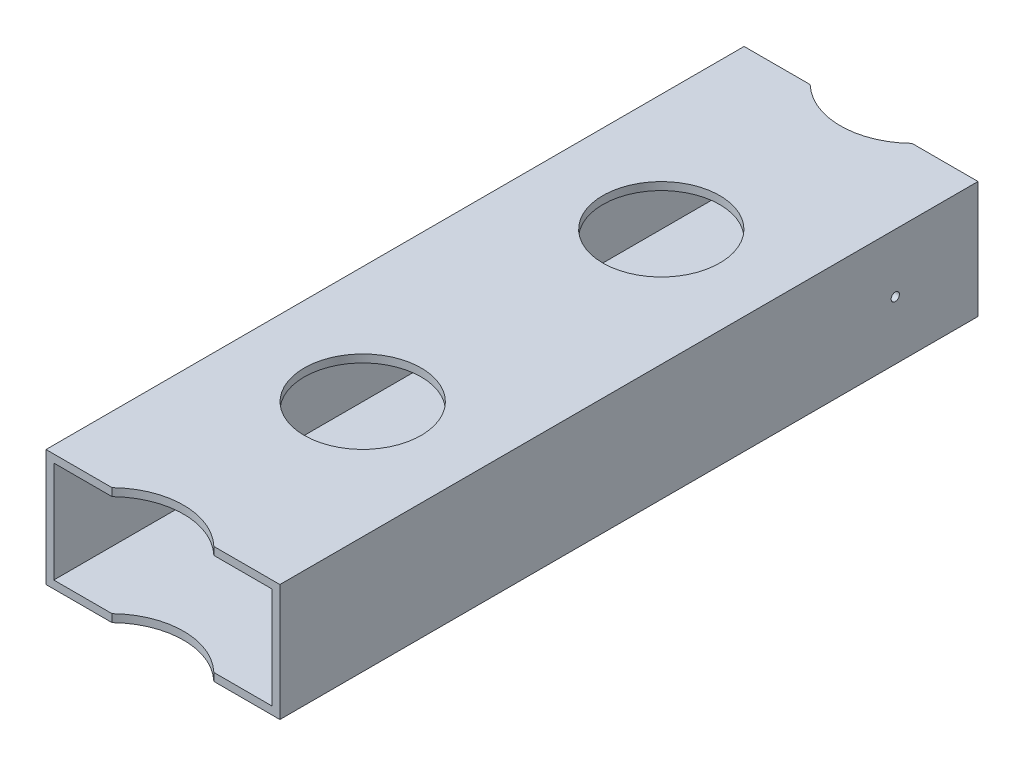
ISO-10303-21;
HEADER;
FILE_DESCRIPTION(('STEP AP214'),'2;1');
FILE_NAME('part.step','',(''),(''),'','','');
FILE_SCHEMA(('AUTOMOTIVE_DESIGN { 1 0 10303 214 1 1 1 1 }'));
ENDSEC;
DATA;
#1=APPLICATION_CONTEXT('core data for automotive mechanical design processes');
#2=APPLICATION_PROTOCOL_DEFINITION('international standard','automotive_design',2000,#1);
#3=PRODUCT_CONTEXT('',#1,'mechanical');
#4=PRODUCT('Part','Part','',(#3));
#5=PRODUCT_RELATED_PRODUCT_CATEGORY('part','',(#4));
#6=PRODUCT_DEFINITION_FORMATION('','',#4);
#7=PRODUCT_DEFINITION_CONTEXT('part definition',#1,'design');
#8=PRODUCT_DEFINITION('design','',#6,#7);
#9=PRODUCT_DEFINITION_SHAPE('','',#8);
#10=(LENGTH_UNIT() NAMED_UNIT(*) SI_UNIT(.MILLI.,.METRE.));
#11=(NAMED_UNIT(*) PLANE_ANGLE_UNIT() SI_UNIT($,.RADIAN.));
#12=(NAMED_UNIT(*) SI_UNIT($,.STERADIAN.) SOLID_ANGLE_UNIT());
#13=UNCERTAINTY_MEASURE_WITH_UNIT(LENGTH_MEASURE(1.E-05),#10,'distance_accuracy_value','');
#14=(GEOMETRIC_REPRESENTATION_CONTEXT(3) GLOBAL_UNCERTAINTY_ASSIGNED_CONTEXT((#13)) GLOBAL_UNIT_ASSIGNED_CONTEXT((#10,
#11,#12)) REPRESENTATION_CONTEXT('',''));
#15=CARTESIAN_POINT('',(0.,0.,0.));
#16=DIRECTION('',(0.,0.,1.));
#17=DIRECTION('',(1.,0.,0.));
#18=AXIS2_PLACEMENT_3D('',#15,#16,#17);
#19=CARTESIAN_POINT('',(0.,-16.51,261.62));
#20=DIRECTION('',(0.,1.,0.));
#21=DIRECTION('',(0.,0.,1.));
#22=AXIS2_PLACEMENT_3D('',#19,#20,#21);
#23=PLANE('',#22);
#24=CARTESIAN_POINT('',(0.,-16.51,179.446397460216));
#25=DIRECTION('',(0.,1.,0.));
#26=DIRECTION('',(0.,0.,1.));
#27=AXIS2_PLACEMENT_3D('',#24,#25,#26);
#28=CIRCLE('',#27,19.05);
#29=CARTESIAN_POINT('',(0.,-16.51,198.496397460216));
#30=VERTEX_POINT('',#29);
#31=EDGE_CURVE('E291',#30,#30,#28,.T.);
#32=ORIENTED_EDGE('',*,*,#31,.F.);
#33=EDGE_LOOP('',(#32));
#34=FACE_BOUND('',#33,.T.);
#35=CARTESIAN_POINT('',(0.,-16.51,82.1736025397836));
#36=DIRECTION('',(0.,1.,0.));
#37=DIRECTION('',(0.,0.,1.));
#38=AXIS2_PLACEMENT_3D('',#35,#36,#37);
#39=CIRCLE('',#38,19.05);
#40=CARTESIAN_POINT('',(0.,-16.51,101.223602539784));
#41=VERTEX_POINT('',#40);
#42=EDGE_CURVE('E311',#41,#41,#39,.T.);
#43=ORIENTED_EDGE('',*,*,#42,.F.);
#44=EDGE_LOOP('',(#43));
#45=FACE_BOUND('',#44,.T.);
#46=DIRECTION('',(-1.,0.,0.));
#47=VECTOR('',#46,1.);
#48=CARTESIAN_POINT('',(0.,-16.51,244.533897460216));
#49=LINE('',#48,#47);
#50=CARTESIAN_POINT('',(-16.5861465159934,-16.51,244.533897460216));
#51=VERTEX_POINT('',#50);
#52=CARTESIAN_POINT('',(-35.56,-16.51,244.533897460216));
#53=VERTEX_POINT('',#52);
#54=EDGE_CURVE('E12',#51,#53,#49,.T.);
#55=ORIENTED_EDGE('',*,*,#54,.F.);
#56=CARTESIAN_POINT('',(0.,-16.51,261.62));
#57=DIRECTION('',(0.,1.,0.));
#58=DIRECTION('',(0.,0.,1.));
#59=AXIS2_PLACEMENT_3D('',#56,#57,#58);
#60=CIRCLE('',#59,23.8125);
#61=CARTESIAN_POINT('',(16.5861465159934,-16.51,244.533897460216));
#62=VERTEX_POINT('',#61);
#63=EDGE_CURVE('E69',#62,#51,#60,.T.);
#64=ORIENTED_EDGE('',*,*,#63,.F.);
#65=DIRECTION('',(-1.,0.,0.));
#66=VECTOR('',#65,1.);
#67=CARTESIAN_POINT('',(0.,-16.51,244.533897460216));
#68=LINE('',#67,#66);
#69=CARTESIAN_POINT('',(35.56,-16.51,244.533897460216));
#70=VERTEX_POINT('',#69);
#71=EDGE_CURVE('E219',#70,#62,#68,.T.);
#72=ORIENTED_EDGE('',*,*,#71,.F.);
#73=DIRECTION('',(0.,0.,-1.));
#74=VECTOR('',#73,1.);
#75=CARTESIAN_POINT('',(35.56,-16.51,261.62));
#76=LINE('',#75,#74);
#77=CARTESIAN_POINT('',(35.56,-16.51,17.0861025397836));
#78=VERTEX_POINT('',#77);
#79=EDGE_CURVE('E241',#70,#78,#76,.T.);
#80=ORIENTED_EDGE('',*,*,#79,.T.);
#81=DIRECTION('',(-1.,0.,0.));
#82=VECTOR('',#81,1.);
#83=CARTESIAN_POINT('',(-1.18304801019034E-13,-16.51,17.0861025397836));
#84=LINE('',#83,#82);
#85=CARTESIAN_POINT('',(16.5861465159934,-16.51,17.0861025397836));
#86=VERTEX_POINT('',#85);
#87=EDGE_CURVE('E210',#78,#86,#84,.T.);
#88=ORIENTED_EDGE('',*,*,#87,.T.);
#89=CARTESIAN_POINT('',(0.,-16.51,0.));
#90=DIRECTION('',(0.,1.,0.));
#91=DIRECTION('',(0.,0.,1.));
#92=AXIS2_PLACEMENT_3D('',#89,#90,#91);
#93=CIRCLE('',#92,23.8125);
#94=CARTESIAN_POINT('',(-16.5861465159934,-16.51,17.0861025397836));
#95=VERTEX_POINT('',#94);
#96=EDGE_CURVE('E213',#95,#86,#93,.T.);
#97=ORIENTED_EDGE('',*,*,#96,.F.);
#98=DIRECTION('',(-1.,0.,0.));
#99=VECTOR('',#98,1.);
#100=CARTESIAN_POINT('',(1.18304801019034E-13,-16.51,17.0861025397836));
#101=LINE('',#100,#99);
#102=CARTESIAN_POINT('',(-35.56,-16.51,17.0861025397836));
#103=VERTEX_POINT('',#102);
#104=EDGE_CURVE('E216',#95,#103,#101,.T.);
#105=ORIENTED_EDGE('',*,*,#104,.T.);
#106=DIRECTION('',(0.,0.,-1.));
#107=VECTOR('',#106,1.);
#108=CARTESIAN_POINT('',(-35.56,-16.51,261.62));
#109=LINE('',#108,#107);
#110=EDGE_CURVE('E237',#53,#103,#109,.T.);
#111=ORIENTED_EDGE('',*,*,#110,.F.);
#112=EDGE_LOOP('',(#55,#64,#72,#80,#88,#97,#105,#111));
#113=FACE_BOUND('',#112,.T.);
#114=ADVANCED_FACE('F61',(#34,#45,#113),#23,.T.);
#115=CARTESIAN_POINT('',(-35.56,0.,261.62));
#116=DIRECTION('',(1.,0.,0.));
#117=DIRECTION('',(0.,0.,-1.));
#118=AXIS2_PLACEMENT_3D('',#115,#116,#117);
#119=PLANE('',#118);
#120=CARTESIAN_POINT('',(-35.56,0.,44.0448471531738));
#121=DIRECTION('',(1.,0.,0.));
#122=DIRECTION('',(0.,0.,-1.));
#123=AXIS2_PLACEMENT_3D('',#120,#121,#122);
#124=CIRCLE('',#123,1.34620000000004);
#125=CARTESIAN_POINT('',(-35.56,0.,42.6986471531738));
#126=VERTEX_POINT('',#125);
#127=EDGE_CURVE('E322',#126,#126,#124,.T.);
#128=ORIENTED_EDGE('',*,*,#127,.F.);
#129=EDGE_LOOP('',(#128));
#130=FACE_BOUND('',#129,.T.);
#131=DIRECTION('',(0.,1.,0.));
#132=VECTOR('',#131,1.);
#133=CARTESIAN_POINT('',(-35.56,0.,244.533897460216));
#134=LINE('',#133,#132);
#135=CARTESIAN_POINT('',(-35.56,16.51,244.533897460216));
#136=VERTEX_POINT('',#135);
#137=EDGE_CURVE('E249',#53,#136,#134,.T.);
#138=ORIENTED_EDGE('',*,*,#137,.F.);
#139=ORIENTED_EDGE('',*,*,#110,.T.);
#140=DIRECTION('',(0.,1.,0.));
#141=VECTOR('',#140,1.);
#142=CARTESIAN_POINT('',(-35.56,0.,17.0861025397836));
#143=LINE('',#142,#141);
#144=CARTESIAN_POINT('',(-35.56,16.51,17.0861025397836));
#145=VERTEX_POINT('',#144);
#146=EDGE_CURVE('E262',#103,#145,#143,.T.);
#147=ORIENTED_EDGE('',*,*,#146,.T.);
#148=DIRECTION('',(0.,0.,-1.));
#149=VECTOR('',#148,1.);
#150=CARTESIAN_POINT('',(-35.56,16.51,261.62));
#151=LINE('',#150,#149);
#152=EDGE_CURVE('E203',#136,#145,#151,.T.);
#153=ORIENTED_EDGE('',*,*,#152,.F.);
#154=EDGE_LOOP('',(#138,#139,#147,#153));
#155=FACE_BOUND('',#154,.T.);
#156=ADVANCED_FACE('F361',(#130,#155),#119,.T.);
#157=CARTESIAN_POINT('',(0.,16.51,261.62));
#158=DIRECTION('',(0.,-1.,0.));
#159=DIRECTION('',(0.,0.,-1.));
#160=AXIS2_PLACEMENT_3D('',#157,#158,#159);
#161=PLANE('',#160);
#162=CARTESIAN_POINT('',(0.,16.51,179.446397460216));
#163=DIRECTION('',(0.,-1.,0.));
#164=DIRECTION('',(0.,0.,-1.));
#165=AXIS2_PLACEMENT_3D('',#162,#163,#164);
#166=CIRCLE('',#165,19.05);
#167=CARTESIAN_POINT('',(0.,16.51,160.396397460216));
#168=VERTEX_POINT('',#167);
#169=EDGE_CURVE('E308',#168,#168,#166,.T.);
#170=ORIENTED_EDGE('',*,*,#169,.F.);
#171=EDGE_LOOP('',(#170));
#172=FACE_BOUND('',#171,.T.);
#173=CARTESIAN_POINT('',(0.,16.51,82.1736025397836));
#174=DIRECTION('',(0.,-1.,0.));
#175=DIRECTION('',(0.,0.,-1.));
#176=AXIS2_PLACEMENT_3D('',#173,#174,#175);
#177=CIRCLE('',#176,19.05);
#178=CARTESIAN_POINT('',(0.,16.51,63.1236025397836));
#179=VERTEX_POINT('',#178);
#180=EDGE_CURVE('E314',#179,#179,#177,.T.);
#181=ORIENTED_EDGE('',*,*,#180,.F.);
#182=EDGE_LOOP('',(#181));
#183=FACE_BOUND('',#182,.T.);
#184=DIRECTION('',(1.,0.,0.));
#185=VECTOR('',#184,1.);
#186=CARTESIAN_POINT('',(0.,16.51,244.533897460216));
#187=LINE('',#186,#185);
#188=CARTESIAN_POINT('',(-16.5861465159934,16.51,244.533897460216));
#189=VERTEX_POINT('',#188);
#190=EDGE_CURVE('E245',#136,#189,#187,.T.);
#191=ORIENTED_EDGE('',*,*,#190,.F.);
#192=ORIENTED_EDGE('',*,*,#152,.T.);
#193=DIRECTION('',(1.,0.,0.));
#194=VECTOR('',#193,1.);
#195=CARTESIAN_POINT('',(1.18304801019034E-13,16.51,17.0861025397836));
#196=LINE('',#195,#194);
#197=CARTESIAN_POINT('',(-16.5861465159934,16.51,17.0861025397836));
#198=VERTEX_POINT('',#197);
#199=EDGE_CURVE('E259',#145,#198,#196,.T.);
#200=ORIENTED_EDGE('',*,*,#199,.T.);
#201=CARTESIAN_POINT('',(0.,16.51,0.));
#202=DIRECTION('',(0.,-1.,0.));
#203=DIRECTION('',(0.,0.,-1.));
#204=AXIS2_PLACEMENT_3D('',#201,#202,#203);
#205=CIRCLE('',#204,23.8125);
#206=CARTESIAN_POINT('',(16.5861465159934,16.51,17.0861025397836));
#207=VERTEX_POINT('',#206);
#208=EDGE_CURVE('E257',#207,#198,#205,.T.);
#209=ORIENTED_EDGE('',*,*,#208,.F.);
#210=DIRECTION('',(1.,0.,0.));
#211=VECTOR('',#210,1.);
#212=CARTESIAN_POINT('',(-1.18304801019034E-13,16.51,17.0861025397836));
#213=LINE('',#212,#211);
#214=CARTESIAN_POINT('',(35.56,16.51,17.0861025397836));
#215=VERTEX_POINT('',#214);
#216=EDGE_CURVE('E264',#207,#215,#213,.T.);
#217=ORIENTED_EDGE('',*,*,#216,.T.);
#218=DIRECTION('',(0.,0.,-1.));
#219=VECTOR('',#218,1.);
#220=CARTESIAN_POINT('',(35.56,16.51,261.62));
#221=LINE('',#220,#219);
#222=CARTESIAN_POINT('',(35.56,16.51,244.533897460216));
#223=VERTEX_POINT('',#222);
#224=EDGE_CURVE('E197',#223,#215,#221,.T.);
#225=ORIENTED_EDGE('',*,*,#224,.F.);
#226=DIRECTION('',(1.,0.,0.));
#227=VECTOR('',#226,1.);
#228=CARTESIAN_POINT('',(0.,16.51,244.533897460216));
#229=LINE('',#228,#227);
#230=CARTESIAN_POINT('',(16.5861465159934,16.51,244.533897460216));
#231=VERTEX_POINT('',#230);
#232=EDGE_CURVE('E253',#231,#223,#229,.T.);
#233=ORIENTED_EDGE('',*,*,#232,.F.);
#234=CARTESIAN_POINT('',(0.,16.51,261.62));
#235=DIRECTION('',(0.,-1.,0.));
#236=DIRECTION('',(0.,0.,-1.));
#237=AXIS2_PLACEMENT_3D('',#234,#235,#236);
#238=CIRCLE('',#237,23.8125);
#239=EDGE_CURVE('E251',#189,#231,#238,.T.);
#240=ORIENTED_EDGE('',*,*,#239,.F.);
#241=EDGE_LOOP('',(#191,#192,#200,#209,#217,#225,#233,#240));
#242=FACE_BOUND('',#241,.T.);
#243=ADVANCED_FACE('F367',(#172,#183,#242),#161,.T.);
#244=CARTESIAN_POINT('',(35.56,0.,261.62));
#245=DIRECTION('',(-1.,0.,0.));
#246=DIRECTION('',(0.,0.,1.));
#247=AXIS2_PLACEMENT_3D('',#244,#245,#246);
#248=PLANE('',#247);
#249=CARTESIAN_POINT('',(35.56,0.,44.0448471531738));
#250=DIRECTION('',(-1.,0.,0.));
#251=DIRECTION('',(0.,0.,1.));
#252=AXIS2_PLACEMENT_3D('',#249,#250,#251);
#253=CIRCLE('',#252,1.34620000000004);
#254=CARTESIAN_POINT('',(35.56,0.,45.3910471531738));
#255=VERTEX_POINT('',#254);
#256=EDGE_CURVE('E332',#255,#255,#253,.T.);
#257=ORIENTED_EDGE('',*,*,#256,.F.);
#258=EDGE_LOOP('',(#257));
#259=FACE_BOUND('',#258,.T.);
#260=DIRECTION('',(0.,-1.,0.));
#261=VECTOR('',#260,1.);
#262=CARTESIAN_POINT('',(35.56,0.,244.533897460216));
#263=LINE('',#262,#261);
#264=EDGE_CURVE('E255',#223,#70,#263,.T.);
#265=ORIENTED_EDGE('',*,*,#264,.F.);
#266=ORIENTED_EDGE('',*,*,#224,.T.);
#267=DIRECTION('',(0.,-1.,0.));
#268=VECTOR('',#267,1.);
#269=CARTESIAN_POINT('',(35.56,0.,17.0861025397836));
#270=LINE('',#269,#268);
#271=EDGE_CURVE('E267',#215,#78,#270,.T.);
#272=ORIENTED_EDGE('',*,*,#271,.T.);
#273=ORIENTED_EDGE('',*,*,#79,.F.);
#274=EDGE_LOOP('',(#265,#266,#272,#273));
#275=FACE_BOUND('',#274,.T.);
#276=ADVANCED_FACE('F378',(#259,#275),#248,.T.);
#277=CARTESIAN_POINT('',(0.,-19.05,0.));
#278=DIRECTION('',(0.,1.,0.));
#279=DIRECTION('',(0.,0.,1.));
#280=AXIS2_PLACEMENT_3D('',#277,#278,#279);
#281=CYLINDRICAL_SURFACE('',#280,23.8125);
#282=ORIENTED_EDGE('',*,*,#208,.T.);
#283=DIRECTION('',(0.,1.,0.));
#284=VECTOR('',#283,1.);
#285=CARTESIAN_POINT('',(-16.5861465159934,-19.05,17.0861025397836));
#286=LINE('',#285,#284);
#287=CARTESIAN_POINT('',(-16.5861465159934,19.05,17.0861025397836));
#288=VERTEX_POINT('',#287);
#289=EDGE_CURVE('E276',#198,#288,#286,.T.);
#290=ORIENTED_EDGE('',*,*,#289,.T.);
#291=CARTESIAN_POINT('',(0.,19.05,0.));
#292=DIRECTION('',(0.,1.,0.));
#293=DIRECTION('',(0.,0.,1.));
#294=AXIS2_PLACEMENT_3D('',#291,#292,#293);
#295=CIRCLE('',#294,23.8125);
#296=CARTESIAN_POINT('',(16.5861465159934,19.05,17.0861025397836));
#297=VERTEX_POINT('',#296);
#298=EDGE_CURVE('E288',#288,#297,#295,.T.);
#299=ORIENTED_EDGE('',*,*,#298,.T.);
#300=DIRECTION('',(0.,1.,0.));
#301=VECTOR('',#300,1.);
#302=CARTESIAN_POINT('',(16.5861465159934,-19.05,17.0861025397836));
#303=LINE('',#302,#301);
#304=EDGE_CURVE('E272',#207,#297,#303,.T.);
#305=ORIENTED_EDGE('',*,*,#304,.F.);
#306=EDGE_LOOP('',(#282,#290,#299,#305));
#307=FACE_BOUND('',#306,.T.);
#308=ADVANCED_FACE('F382',(#307),#281,.F.);
#309=ORIENTED_EDGE('',*,*,#96,.T.);
#310=CARTESIAN_POINT('',(16.5861465159934,-19.05,17.0861025397836));
#311=VERTEX_POINT('',#310);
#312=EDGE_CURVE('E270',#311,#86,#303,.T.);
#313=ORIENTED_EDGE('',*,*,#312,.F.);
#314=CARTESIAN_POINT('',(0.,-19.05,0.));
#315=DIRECTION('',(0.,1.,0.));
#316=DIRECTION('',(0.,0.,1.));
#317=AXIS2_PLACEMENT_3D('',#314,#315,#316);
#318=CIRCLE('',#317,23.8125);
#319=CARTESIAN_POINT('',(-16.5861465159934,-19.05,17.0861025397836));
#320=VERTEX_POINT('',#319);
#321=EDGE_CURVE('E284',#320,#311,#318,.T.);
#322=ORIENTED_EDGE('',*,*,#321,.F.);
#323=EDGE_CURVE('E277',#320,#95,#286,.T.);
#324=ORIENTED_EDGE('',*,*,#323,.T.);
#325=EDGE_LOOP('',(#309,#313,#322,#324));
#326=FACE_BOUND('',#325,.T.);
#327=ADVANCED_FACE('F373',(#326),#281,.F.);
#328=CARTESIAN_POINT('',(0.,-19.05,17.0861025397836));
#329=DIRECTION('',(0.,0.,-1.));
#330=DIRECTION('',(-1.,0.,0.));
#331=AXIS2_PLACEMENT_3D('',#328,#329,#330);
#332=PLANE('',#331);
#333=ORIENTED_EDGE('',*,*,#146,.F.);
#334=ORIENTED_EDGE('',*,*,#104,.F.);
#335=ORIENTED_EDGE('',*,*,#323,.F.);
#336=DIRECTION('',(-1.,0.,0.));
#337=VECTOR('',#336,1.);
#338=CARTESIAN_POINT('',(0.,-19.05,17.0861025397836));
#339=LINE('',#338,#337);
#340=CARTESIAN_POINT('',(-38.1,-19.05,17.0861025397836));
#341=VERTEX_POINT('',#340);
#342=EDGE_CURVE('E292',#320,#341,#339,.T.);
#343=ORIENTED_EDGE('',*,*,#342,.T.);
#344=DIRECTION('',(0.,1.,0.));
#345=VECTOR('',#344,1.);
#346=CARTESIAN_POINT('',(-38.1,-19.05,17.0861025397836));
#347=LINE('',#346,#345);
#348=CARTESIAN_POINT('',(-38.1,19.05,17.0861025397836));
#349=VERTEX_POINT('',#348);
#350=EDGE_CURVE('E274',#341,#349,#347,.T.);
#351=ORIENTED_EDGE('',*,*,#350,.T.);
#352=DIRECTION('',(-1.,0.,0.));
#353=VECTOR('',#352,1.);
#354=CARTESIAN_POINT('',(0.,19.05,17.0861025397836));
#355=LINE('',#354,#353);
#356=EDGE_CURVE('E281',#288,#349,#355,.T.);
#357=ORIENTED_EDGE('',*,*,#356,.F.);
#358=ORIENTED_EDGE('',*,*,#289,.F.);
#359=ORIENTED_EDGE('',*,*,#199,.F.);
#360=EDGE_LOOP('',(#333,#334,#335,#343,#351,#357,#358,#359));
#361=FACE_BOUND('',#360,.T.);
#362=ADVANCED_FACE('F410',(#361),#332,.T.);
#363=CARTESIAN_POINT('',(0.,-19.05,17.0861025397836));
#364=DIRECTION('',(0.,0.,-1.));
#365=DIRECTION('',(-1.,0.,0.));
#366=AXIS2_PLACEMENT_3D('',#363,#364,#365);
#367=PLANE('',#366);
#368=ORIENTED_EDGE('',*,*,#304,.T.);
#369=DIRECTION('',(-1.,0.,0.));
#370=VECTOR('',#369,1.);
#371=CARTESIAN_POINT('',(0.,19.05,17.0861025397836));
#372=LINE('',#371,#370);
#373=CARTESIAN_POINT('',(38.1,19.05,17.0861025397836));
#374=VERTEX_POINT('',#373);
#375=EDGE_CURVE('E285',#374,#297,#372,.T.);
#376=ORIENTED_EDGE('',*,*,#375,.F.);
#377=DIRECTION('',(0.,1.,0.));
#378=VECTOR('',#377,1.);
#379=CARTESIAN_POINT('',(38.1,-19.05,17.0861025397836));
#380=LINE('',#379,#378);
#381=CARTESIAN_POINT('',(38.1,-19.05,17.0861025397836));
#382=VERTEX_POINT('',#381);
#383=EDGE_CURVE('E84',#382,#374,#380,.T.);
#384=ORIENTED_EDGE('',*,*,#383,.F.);
#385=DIRECTION('',(-1.,0.,0.));
#386=VECTOR('',#385,1.);
#387=CARTESIAN_POINT('',(0.,-19.05,17.0861025397836));
#388=LINE('',#387,#386);
#389=EDGE_CURVE('E195',#382,#311,#388,.T.);
#390=ORIENTED_EDGE('',*,*,#389,.T.);
#391=ORIENTED_EDGE('',*,*,#312,.T.);
#392=ORIENTED_EDGE('',*,*,#87,.F.);
#393=ORIENTED_EDGE('',*,*,#271,.F.);
#394=ORIENTED_EDGE('',*,*,#216,.F.);
#395=EDGE_LOOP('',(#368,#376,#384,#390,#391,#392,#393,#394));
#396=FACE_BOUND('',#395,.T.);
#397=ADVANCED_FACE('F413',(#396),#367,.T.);
#398=CARTESIAN_POINT('',(0.,-19.05,261.62));
#399=DIRECTION('',(0.,1.,0.));
#400=DIRECTION('',(0.,0.,1.));
#401=AXIS2_PLACEMENT_3D('',#398,#399,#400);
#402=CYLINDRICAL_SURFACE('',#401,23.8125);
#403=ORIENTED_EDGE('',*,*,#239,.T.);
#404=DIRECTION('',(0.,1.,0.));
#405=VECTOR('',#404,1.);
#406=CARTESIAN_POINT('',(16.5861465159934,-19.05,244.533897460216));
#407=LINE('',#406,#405);
#408=CARTESIAN_POINT('',(16.5861465159934,19.05,244.533897460216));
#409=VERTEX_POINT('',#408);
#410=EDGE_CURVE('E190',#231,#409,#407,.T.);
#411=ORIENTED_EDGE('',*,*,#410,.T.);
#412=CARTESIAN_POINT('',(0.,19.05,261.62));
#413=DIRECTION('',(0.,1.,0.));
#414=DIRECTION('',(0.,0.,1.));
#415=AXIS2_PLACEMENT_3D('',#412,#413,#414);
#416=CIRCLE('',#415,23.8125);
#417=CARTESIAN_POINT('',(-16.5861465159934,19.05,244.533897460216));
#418=VERTEX_POINT('',#417);
#419=EDGE_CURVE('E300',#409,#418,#416,.T.);
#420=ORIENTED_EDGE('',*,*,#419,.T.);
#421=DIRECTION('',(0.,1.,0.));
#422=VECTOR('',#421,1.);
#423=CARTESIAN_POINT('',(-16.5861465159934,-19.05,244.533897460216));
#424=LINE('',#423,#422);
#425=EDGE_CURVE('E233',#189,#418,#424,.T.);
#426=ORIENTED_EDGE('',*,*,#425,.F.);
#427=EDGE_LOOP('',(#403,#411,#420,#426));
#428=FACE_BOUND('',#427,.T.);
#429=ADVANCED_FACE('F428',(#428),#402,.F.);
#430=CARTESIAN_POINT('',(0.,-19.05,244.533897460216));
#431=DIRECTION('',(0.,0.,-1.));
#432=DIRECTION('',(-1.,0.,0.));
#433=AXIS2_PLACEMENT_3D('',#430,#431,#432);
#434=PLANE('',#433);
#435=ORIENTED_EDGE('',*,*,#190,.T.);
#436=ORIENTED_EDGE('',*,*,#425,.T.);
#437=DIRECTION('',(-1.,0.,0.));
#438=VECTOR('',#437,1.);
#439=CARTESIAN_POINT('',(0.,19.05,244.533897460216));
#440=LINE('',#439,#438);
#441=CARTESIAN_POINT('',(-38.1,19.05,244.533897460216));
#442=VERTEX_POINT('',#441);
#443=EDGE_CURVE('E182',#418,#442,#440,.T.);
#444=ORIENTED_EDGE('',*,*,#443,.T.);
#445=DIRECTION('',(0.,1.,0.));
#446=VECTOR('',#445,1.);
#447=CARTESIAN_POINT('',(-38.1,-19.05,244.533897460216));
#448=LINE('',#447,#446);
#449=CARTESIAN_POINT('',(-38.1,-19.05,244.533897460216));
#450=VERTEX_POINT('',#449);
#451=EDGE_CURVE('E232',#450,#442,#448,.T.);
#452=ORIENTED_EDGE('',*,*,#451,.F.);
#453=DIRECTION('',(-1.,0.,0.));
#454=VECTOR('',#453,1.);
#455=CARTESIAN_POINT('',(0.,-19.05,244.533897460216));
#456=LINE('',#455,#454);
#457=CARTESIAN_POINT('',(-16.5861465159934,-19.05,244.533897460216));
#458=VERTEX_POINT('',#457);
#459=EDGE_CURVE('E191',#458,#450,#456,.T.);
#460=ORIENTED_EDGE('',*,*,#459,.F.);
#461=EDGE_CURVE('E223',#458,#51,#424,.T.);
#462=ORIENTED_EDGE('',*,*,#461,.T.);
#463=ORIENTED_EDGE('',*,*,#54,.T.);
#464=ORIENTED_EDGE('',*,*,#137,.T.);
#465=EDGE_LOOP('',(#435,#436,#444,#452,#460,#462,#463,#464));
#466=FACE_BOUND('',#465,.T.);
#467=ADVANCED_FACE('F229',(#466),#434,.F.);
#468=ORIENTED_EDGE('',*,*,#63,.T.);
#469=ORIENTED_EDGE('',*,*,#461,.F.);
#470=CARTESIAN_POINT('',(0.,-19.05,261.62));
#471=DIRECTION('',(0.,1.,0.));
#472=DIRECTION('',(0.,0.,1.));
#473=AXIS2_PLACEMENT_3D('',#470,#471,#472);
#474=CIRCLE('',#473,23.8125);
#475=CARTESIAN_POINT('',(16.5861465159934,-19.05,244.533897460216));
#476=VERTEX_POINT('',#475);
#477=EDGE_CURVE('E76',#476,#458,#474,.T.);
#478=ORIENTED_EDGE('',*,*,#477,.F.);
#479=EDGE_CURVE('E179',#476,#62,#407,.T.);
#480=ORIENTED_EDGE('',*,*,#479,.T.);
#481=EDGE_LOOP('',(#468,#469,#478,#480));
#482=FACE_BOUND('',#481,.T.);
#483=ADVANCED_FACE('F222',(#482),#402,.F.);
#484=CARTESIAN_POINT('',(0.,-19.05,244.533897460216));
#485=DIRECTION('',(0.,0.,-1.));
#486=DIRECTION('',(-1.,0.,0.));
#487=AXIS2_PLACEMENT_3D('',#484,#485,#486);
#488=PLANE('',#487);
#489=ORIENTED_EDGE('',*,*,#232,.T.);
#490=ORIENTED_EDGE('',*,*,#264,.T.);
#491=ORIENTED_EDGE('',*,*,#71,.T.);
#492=ORIENTED_EDGE('',*,*,#479,.F.);
#493=DIRECTION('',(-1.,0.,0.));
#494=VECTOR('',#493,1.);
#495=CARTESIAN_POINT('',(0.,-19.05,244.533897460216));
#496=LINE('',#495,#494);
#497=CARTESIAN_POINT('',(38.1,-19.05,244.533897460216));
#498=VERTEX_POINT('',#497);
#499=EDGE_CURVE('E173',#498,#476,#496,.T.);
#500=ORIENTED_EDGE('',*,*,#499,.F.);
#501=DIRECTION('',(0.,1.,0.));
#502=VECTOR('',#501,1.);
#503=CARTESIAN_POINT('',(38.1,-19.05,244.533897460216));
#504=LINE('',#503,#502);
#505=CARTESIAN_POINT('',(38.1,19.05,244.533897460216));
#506=VERTEX_POINT('',#505);
#507=EDGE_CURVE('E177',#498,#506,#504,.T.);
#508=ORIENTED_EDGE('',*,*,#507,.T.);
#509=DIRECTION('',(-1.,0.,0.));
#510=VECTOR('',#509,1.);
#511=CARTESIAN_POINT('',(0.,19.05,244.533897460216));
#512=LINE('',#511,#510);
#513=EDGE_CURVE('E280',#506,#409,#512,.T.);
#514=ORIENTED_EDGE('',*,*,#513,.T.);
#515=ORIENTED_EDGE('',*,*,#410,.F.);
#516=EDGE_LOOP('',(#489,#490,#491,#492,#500,#508,#514,#515));
#517=FACE_BOUND('',#516,.T.);
#518=ADVANCED_FACE('F175',(#517),#488,.F.);
#519=CARTESIAN_POINT('',(38.1,-19.05,261.62));
#520=DIRECTION('',(-1.,0.,0.));
#521=DIRECTION('',(0.,0.,1.));
#522=AXIS2_PLACEMENT_3D('',#519,#520,#521);
#523=PLANE('',#522);
#524=CARTESIAN_POINT('',(38.1,0.,44.0448471531738));
#525=DIRECTION('',(1.,0.,0.));
#526=DIRECTION('',(0.,0.,-1.));
#527=AXIS2_PLACEMENT_3D('',#524,#525,#526);
#528=CIRCLE('',#527,1.34620000000004);
#529=CARTESIAN_POINT('',(38.1,0.,42.6986471531738));
#530=VERTEX_POINT('',#529);
#531=EDGE_CURVE('E336',#530,#530,#528,.T.);
#532=ORIENTED_EDGE('',*,*,#531,.F.);
#533=EDGE_LOOP('',(#532));
#534=FACE_BOUND('',#533,.T.);
#535=DIRECTION('',(0.,0.,-1.));
#536=VECTOR('',#535,1.);
#537=CARTESIAN_POINT('',(38.1,19.05,261.62));
#538=LINE('',#537,#536);
#539=EDGE_CURVE('E189',#506,#374,#538,.T.);
#540=ORIENTED_EDGE('',*,*,#539,.F.);
#541=ORIENTED_EDGE('',*,*,#507,.F.);
#542=DIRECTION('',(0.,0.,-1.));
#543=VECTOR('',#542,1.);
#544=CARTESIAN_POINT('',(38.1,-19.05,261.62));
#545=LINE('',#544,#543);
#546=EDGE_CURVE('E187',#498,#382,#545,.T.);
#547=ORIENTED_EDGE('',*,*,#546,.T.);
#548=ORIENTED_EDGE('',*,*,#383,.T.);
#549=EDGE_LOOP('',(#540,#541,#547,#548));
#550=FACE_BOUND('',#549,.T.);
#551=ADVANCED_FACE('F63',(#534,#550),#523,.F.);
#552=CARTESIAN_POINT('',(-38.1,19.05,261.62));
#553=DIRECTION('',(0.,-1.,0.));
#554=DIRECTION('',(0.,0.,-1.));
#555=AXIS2_PLACEMENT_3D('',#552,#553,#554);
#556=PLANE('',#555);
#557=CARTESIAN_POINT('',(0.,19.05,179.446397460216));
#558=DIRECTION('',(0.,1.,0.));
#559=DIRECTION('',(0.,0.,1.));
#560=AXIS2_PLACEMENT_3D('',#557,#558,#559);
#561=CIRCLE('',#560,19.05);
#562=CARTESIAN_POINT('',(0.,19.05,198.496397460216));
#563=VERTEX_POINT('',#562);
#564=EDGE_CURVE('E325',#563,#563,#561,.T.);
#565=ORIENTED_EDGE('',*,*,#564,.F.);
#566=EDGE_LOOP('',(#565));
#567=FACE_BOUND('',#566,.T.);
#568=CARTESIAN_POINT('',(0.,19.05,82.1736025397836));
#569=DIRECTION('',(0.,1.,0.));
#570=DIRECTION('',(0.,0.,1.));
#571=AXIS2_PLACEMENT_3D('',#568,#569,#570);
#572=CIRCLE('',#571,19.05);
#573=CARTESIAN_POINT('',(0.,19.05,101.223602539784));
#574=VERTEX_POINT('',#573);
#575=EDGE_CURVE('E318',#574,#574,#572,.T.);
#576=ORIENTED_EDGE('',*,*,#575,.F.);
#577=EDGE_LOOP('',(#576));
#578=FACE_BOUND('',#577,.T.);
#579=DIRECTION('',(0.,0.,-1.));
#580=VECTOR('',#579,1.);
#581=CARTESIAN_POINT('',(-38.1,19.05,261.62));
#582=LINE('',#581,#580);
#583=EDGE_CURVE('E200',#442,#349,#582,.T.);
#584=ORIENTED_EDGE('',*,*,#583,.F.);
#585=ORIENTED_EDGE('',*,*,#443,.F.);
#586=ORIENTED_EDGE('',*,*,#419,.F.);
#587=ORIENTED_EDGE('',*,*,#513,.F.);
#588=ORIENTED_EDGE('',*,*,#539,.T.);
#589=ORIENTED_EDGE('',*,*,#375,.T.);
#590=ORIENTED_EDGE('',*,*,#298,.F.);
#591=ORIENTED_EDGE('',*,*,#356,.T.);
#592=EDGE_LOOP('',(#584,#585,#586,#587,#588,#589,#590,#591));
#593=FACE_BOUND('',#592,.T.);
#594=ADVANCED_FACE('F389',(#567,#578,#593),#556,.F.);
#595=CARTESIAN_POINT('',(-38.1,-19.05,261.62));
#596=DIRECTION('',(1.,0.,0.));
#597=DIRECTION('',(0.,0.,-1.));
#598=AXIS2_PLACEMENT_3D('',#595,#596,#597);
#599=PLANE('',#598);
#600=CARTESIAN_POINT('',(-38.1,0.,44.0448471531738));
#601=DIRECTION('',(1.,0.,0.));
#602=DIRECTION('',(0.,0.,-1.));
#603=AXIS2_PLACEMENT_3D('',#600,#601,#602);
#604=CIRCLE('',#603,1.34620000000004);
#605=CARTESIAN_POINT('',(-38.1,0.,42.6986471531738));
#606=VERTEX_POINT('',#605);
#607=EDGE_CURVE('E335',#606,#606,#604,.T.);
#608=ORIENTED_EDGE('',*,*,#607,.T.);
#609=EDGE_LOOP('',(#608));
#610=FACE_BOUND('',#609,.T.);
#611=DIRECTION('',(0.,0.,-1.));
#612=VECTOR('',#611,1.);
#613=CARTESIAN_POINT('',(-38.1,-19.05,261.62));
#614=LINE('',#613,#612);
#615=EDGE_CURVE('E196',#450,#341,#614,.T.);
#616=ORIENTED_EDGE('',*,*,#615,.F.);
#617=ORIENTED_EDGE('',*,*,#451,.T.);
#618=ORIENTED_EDGE('',*,*,#583,.T.);
#619=ORIENTED_EDGE('',*,*,#350,.F.);
#620=EDGE_LOOP('',(#616,#617,#618,#619));
#621=FACE_BOUND('',#620,.T.);
#622=ADVANCED_FACE('F342',(#610,#621),#599,.F.);
#623=CARTESIAN_POINT('',(-38.1,-19.05,261.62));
#624=DIRECTION('',(0.,1.,0.));
#625=DIRECTION('',(0.,0.,1.));
#626=AXIS2_PLACEMENT_3D('',#623,#624,#625);
#627=PLANE('',#626);
#628=CARTESIAN_POINT('',(0.,-19.05,179.446397460216));
#629=DIRECTION('',(0.,1.,0.));
#630=DIRECTION('',(0.,0.,1.));
#631=AXIS2_PLACEMENT_3D('',#628,#629,#630);
#632=CIRCLE('',#631,19.05);
#633=CARTESIAN_POINT('',(0.,-19.05,198.496397460216));
#634=VERTEX_POINT('',#633);
#635=EDGE_CURVE('E317',#634,#634,#632,.T.);
#636=ORIENTED_EDGE('',*,*,#635,.T.);
#637=EDGE_LOOP('',(#636));
#638=FACE_BOUND('',#637,.T.);
#639=CARTESIAN_POINT('',(0.,-19.05,82.1736025397836));
#640=DIRECTION('',(0.,1.,0.));
#641=DIRECTION('',(0.,0.,1.));
#642=AXIS2_PLACEMENT_3D('',#639,#640,#641);
#643=CIRCLE('',#642,19.05);
#644=CARTESIAN_POINT('',(0.,-19.05,101.223602539784));
#645=VERTEX_POINT('',#644);
#646=EDGE_CURVE('E321',#645,#645,#643,.T.);
#647=ORIENTED_EDGE('',*,*,#646,.T.);
#648=EDGE_LOOP('',(#647));
#649=FACE_BOUND('',#648,.T.);
#650=ORIENTED_EDGE('',*,*,#477,.T.);
#651=ORIENTED_EDGE('',*,*,#459,.T.);
#652=ORIENTED_EDGE('',*,*,#615,.T.);
#653=ORIENTED_EDGE('',*,*,#342,.F.);
#654=ORIENTED_EDGE('',*,*,#321,.T.);
#655=ORIENTED_EDGE('',*,*,#389,.F.);
#656=ORIENTED_EDGE('',*,*,#546,.F.);
#657=ORIENTED_EDGE('',*,*,#499,.T.);
#658=EDGE_LOOP('',(#650,#651,#652,#653,#654,#655,#656,#657));
#659=FACE_BOUND('',#658,.T.);
#660=ADVANCED_FACE('F193',(#638,#649,#659),#627,.F.);
#661=CARTESIAN_POINT('',(0.,-19.05,82.1736025397836));
#662=DIRECTION('',(0.,1.,0.));
#663=DIRECTION('',(0.,0.,1.));
#664=AXIS2_PLACEMENT_3D('',#661,#662,#663);
#665=CYLINDRICAL_SURFACE('',#664,19.05);
#666=ORIENTED_EDGE('',*,*,#42,.T.);
#667=EDGE_LOOP('',(#666));
#668=FACE_BOUND('',#667,.T.);
#669=ORIENTED_EDGE('',*,*,#646,.F.);
#670=EDGE_LOOP('',(#669));
#671=FACE_BOUND('',#670,.T.);
#672=ADVANCED_FACE('F386',(#668,#671),#665,.F.);
#673=CARTESIAN_POINT('',(0.,-19.05,179.446397460216));
#674=DIRECTION('',(0.,1.,0.));
#675=DIRECTION('',(0.,0.,1.));
#676=AXIS2_PLACEMENT_3D('',#673,#674,#675);
#677=CYLINDRICAL_SURFACE('',#676,19.05);
#678=ORIENTED_EDGE('',*,*,#31,.T.);
#679=EDGE_LOOP('',(#678));
#680=FACE_BOUND('',#679,.T.);
#681=ORIENTED_EDGE('',*,*,#635,.F.);
#682=EDGE_LOOP('',(#681));
#683=FACE_BOUND('',#682,.T.);
#684=ADVANCED_FACE('F359',(#680,#683),#677,.F.);
#685=ORIENTED_EDGE('',*,*,#180,.T.);
#686=EDGE_LOOP('',(#685));
#687=FACE_BOUND('',#686,.T.);
#688=ORIENTED_EDGE('',*,*,#575,.T.);
#689=EDGE_LOOP('',(#688));
#690=FACE_BOUND('',#689,.T.);
#691=ADVANCED_FACE('F356',(#687,#690),#665,.F.);
#692=ORIENTED_EDGE('',*,*,#169,.T.);
#693=EDGE_LOOP('',(#692));
#694=FACE_BOUND('',#693,.T.);
#695=ORIENTED_EDGE('',*,*,#564,.T.);
#696=EDGE_LOOP('',(#695));
#697=FACE_BOUND('',#696,.T.);
#698=ADVANCED_FACE('F348',(#694,#697),#677,.F.);
#699=CARTESIAN_POINT('',(-38.1,0.,44.0448471531738));
#700=DIRECTION('',(1.,0.,0.));
#701=DIRECTION('',(0.,0.,-1.));
#702=AXIS2_PLACEMENT_3D('',#699,#700,#701);
#703=CYLINDRICAL_SURFACE('',#702,1.34620000000004);
#704=ORIENTED_EDGE('',*,*,#127,.T.);
#705=EDGE_LOOP('',(#704));
#706=FACE_BOUND('',#705,.T.);
#707=ORIENTED_EDGE('',*,*,#607,.F.);
#708=EDGE_LOOP('',(#707));
#709=FACE_BOUND('',#708,.T.);
#710=ADVANCED_FACE('F345',(#706,#709),#703,.F.);
#711=ORIENTED_EDGE('',*,*,#256,.T.);
#712=EDGE_LOOP('',(#711));
#713=FACE_BOUND('',#712,.T.);
#714=ORIENTED_EDGE('',*,*,#531,.T.);
#715=EDGE_LOOP('',(#714));
#716=FACE_BOUND('',#715,.T.);
#717=ADVANCED_FACE('F347',(#713,#716),#703,.F.);
#718=CLOSED_SHELL('',(#114,#156,#243,#276,#308,#327,#362,#397,#429,#467,#483,#518,#551,#594,
#622,#660,#672,#684,#691,#698,#710,#717));
#719=MANIFOLD_SOLID_BREP('B2',#718);
#720=ADVANCED_BREP_SHAPE_REPRESENTATION('',(#18,#719),#14);
#721=SHAPE_DEFINITION_REPRESENTATION(#9,#720);
ENDSEC;
END-ISO-10303-21;
